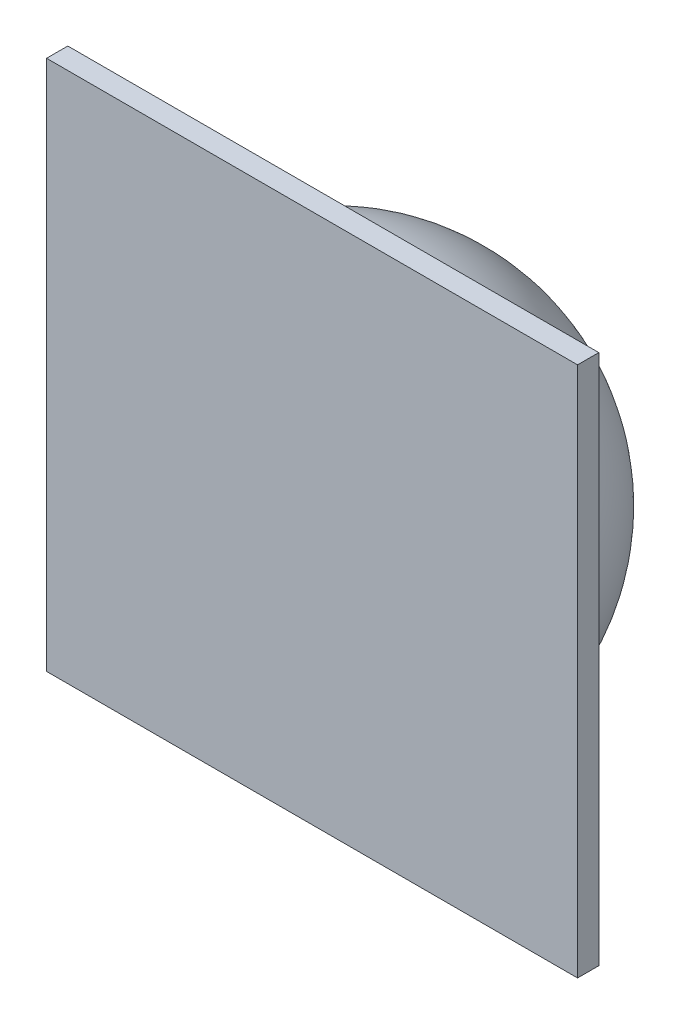
ISO-10303-21;
HEADER;
FILE_DESCRIPTION(('STEP AP214'),'2;1');
FILE_NAME('part.step','',(''),(''),'','','');
FILE_SCHEMA(('AUTOMOTIVE_DESIGN { 1 0 10303 214 1 1 1 1 }'));
ENDSEC;
DATA;
#1=APPLICATION_CONTEXT('core data for automotive mechanical design processes');
#2=APPLICATION_PROTOCOL_DEFINITION('international standard','automotive_design',2000,#1);
#3=PRODUCT_CONTEXT('',#1,'mechanical');
#4=PRODUCT('Part','Part','',(#3));
#5=PRODUCT_RELATED_PRODUCT_CATEGORY('part','',(#4));
#6=PRODUCT_DEFINITION_FORMATION('','',#4);
#7=PRODUCT_DEFINITION_CONTEXT('part definition',#1,'design');
#8=PRODUCT_DEFINITION('design','',#6,#7);
#9=PRODUCT_DEFINITION_SHAPE('','',#8);
#10=(LENGTH_UNIT() NAMED_UNIT(*) SI_UNIT(.MILLI.,.METRE.));
#11=(NAMED_UNIT(*) PLANE_ANGLE_UNIT() SI_UNIT($,.RADIAN.));
#12=(NAMED_UNIT(*) SI_UNIT($,.STERADIAN.) SOLID_ANGLE_UNIT());
#13=UNCERTAINTY_MEASURE_WITH_UNIT(LENGTH_MEASURE(1.E-05),#10,'distance_accuracy_value','');
#14=(GEOMETRIC_REPRESENTATION_CONTEXT(3) GLOBAL_UNCERTAINTY_ASSIGNED_CONTEXT((#13)) GLOBAL_UNIT_ASSIGNED_CONTEXT((#10,
#11,#12)) REPRESENTATION_CONTEXT('',''));
#15=CARTESIAN_POINT('',(0.,0.,0.));
#16=DIRECTION('',(0.,0.,1.));
#17=DIRECTION('',(1.,0.,0.));
#18=AXIS2_PLACEMENT_3D('',#15,#16,#17);
#19=CARTESIAN_POINT('',(0.,0.,-2.80389993930281));
#20=DIRECTION('',(0.,0.,-1.));
#21=DIRECTION('',(-1.,0.,0.));
#22=AXIS2_PLACEMENT_3D('',#19,#20,#21);
#23=PLANE('',#22);
#24=DIRECTION('',(0.,1.,0.));
#25=VECTOR('',#24,1.);
#26=CARTESIAN_POINT('',(7.5,-7.5,-2.80389993930281));
#27=LINE('',#26,#25);
#28=CARTESIAN_POINT('',(7.5,-7.5,-2.80389993930281));
#29=VERTEX_POINT('',#28);
#30=CARTESIAN_POINT('',(7.5,7.5,-2.80389993930281));
#31=VERTEX_POINT('',#30);
#32=EDGE_CURVE('E145',#29,#31,#27,.T.);
#33=ORIENTED_EDGE('',*,*,#32,.F.);
#34=DIRECTION('',(1.,0.,0.));
#35=VECTOR('',#34,1.);
#36=CARTESIAN_POINT('',(-7.5,-7.5,-2.80389993930281));
#37=LINE('',#36,#35);
#38=CARTESIAN_POINT('',(-7.5,-7.5,-2.80389993930281));
#39=VERTEX_POINT('',#38);
#40=EDGE_CURVE('E87',#39,#29,#37,.T.);
#41=ORIENTED_EDGE('',*,*,#40,.F.);
#42=DIRECTION('',(0.,-1.,0.));
#43=VECTOR('',#42,1.);
#44=CARTESIAN_POINT('',(-7.5,-7.5,-2.80389993930281));
#45=LINE('',#44,#43);
#46=CARTESIAN_POINT('',(-7.5,7.5,-2.80389993930281));
#47=VERTEX_POINT('',#46);
#48=EDGE_CURVE('E168',#47,#39,#45,.T.);
#49=ORIENTED_EDGE('',*,*,#48,.F.);
#50=DIRECTION('',(-1.,0.,0.));
#51=VECTOR('',#50,1.);
#52=CARTESIAN_POINT('',(-7.5,7.5,-2.80389993930281));
#53=LINE('',#52,#51);
#54=EDGE_CURVE('E150',#31,#47,#53,.T.);
#55=ORIENTED_EDGE('',*,*,#54,.F.);
#56=EDGE_LOOP('',(#33,#41,#49,#55));
#57=FACE_BOUND('',#56,.T.);
#58=CARTESIAN_POINT('',(0.,0.,-2.80389993930281));
#59=DIRECTION('',(0.,0.,-1.));
#60=DIRECTION('',(-1.,0.,0.));
#61=AXIS2_PLACEMENT_3D('',#58,#59,#60);
#62=CIRCLE('',#61,6.);
#63=CARTESIAN_POINT('',(-6.,0.,-2.80389993930281));
#64=VERTEX_POINT('',#63);
#65=EDGE_CURVE('E11',#64,#64,#62,.T.);
#66=ORIENTED_EDGE('',*,*,#65,.F.);
#67=EDGE_LOOP('',(#66));
#68=FACE_BOUND('',#67,.T.);
#69=ADVANCED_FACE('F40',(#57,#68),#23,.T.);
#70=CARTESIAN_POINT('',(7.5,-7.5,-2.20389993930281));
#71=DIRECTION('',(-1.,0.,0.));
#72=DIRECTION('',(0.,0.,1.));
#73=AXIS2_PLACEMENT_3D('',#70,#71,#72);
#74=PLANE('',#73);
#75=ORIENTED_EDGE('',*,*,#32,.T.);
#76=DIRECTION('',(0.,0.,-1.));
#77=VECTOR('',#76,1.);
#78=CARTESIAN_POINT('',(7.5,7.5,-2.20389993930281));
#79=LINE('',#78,#77);
#80=CARTESIAN_POINT('',(7.5,7.5,-2.20389993930281));
#81=VERTEX_POINT('',#80);
#82=EDGE_CURVE('E182',#81,#31,#79,.T.);
#83=ORIENTED_EDGE('',*,*,#82,.F.);
#84=DIRECTION('',(0.,1.,0.));
#85=VECTOR('',#84,1.);
#86=CARTESIAN_POINT('',(7.5,-7.5,-2.20389993930281));
#87=LINE('',#86,#85);
#88=CARTESIAN_POINT('',(7.5,-7.5,-2.20389993930281));
#89=VERTEX_POINT('',#88);
#90=EDGE_CURVE('E155',#89,#81,#87,.T.);
#91=ORIENTED_EDGE('',*,*,#90,.F.);
#92=DIRECTION('',(0.,0.,-1.));
#93=VECTOR('',#92,1.);
#94=CARTESIAN_POINT('',(7.5,-7.5,-2.20389993930281));
#95=LINE('',#94,#93);
#96=EDGE_CURVE('E164',#89,#29,#95,.T.);
#97=ORIENTED_EDGE('',*,*,#96,.T.);
#98=EDGE_LOOP('',(#75,#83,#91,#97));
#99=FACE_BOUND('',#98,.T.);
#100=ADVANCED_FACE('F42',(#99),#74,.F.);
#101=CARTESIAN_POINT('',(-7.5,7.5,-2.20389993930281));
#102=DIRECTION('',(0.,-1.,0.));
#103=DIRECTION('',(0.,0.,-1.));
#104=AXIS2_PLACEMENT_3D('',#101,#102,#103);
#105=PLANE('',#104);
#106=ORIENTED_EDGE('',*,*,#54,.T.);
#107=DIRECTION('',(0.,0.,-1.));
#108=VECTOR('',#107,1.);
#109=CARTESIAN_POINT('',(-7.5,7.5,-2.20389993930281));
#110=LINE('',#109,#108);
#111=CARTESIAN_POINT('',(-7.5,7.5,-2.20389993930281));
#112=VERTEX_POINT('',#111);
#113=EDGE_CURVE('E178',#112,#47,#110,.T.);
#114=ORIENTED_EDGE('',*,*,#113,.F.);
#115=DIRECTION('',(-1.,0.,0.));
#116=VECTOR('',#115,1.);
#117=CARTESIAN_POINT('',(-7.5,7.5,-2.20389993930281));
#118=LINE('',#117,#116);
#119=EDGE_CURVE('E95',#81,#112,#118,.T.);
#120=ORIENTED_EDGE('',*,*,#119,.F.);
#121=ORIENTED_EDGE('',*,*,#82,.T.);
#122=EDGE_LOOP('',(#106,#114,#120,#121));
#123=FACE_BOUND('',#122,.T.);
#124=ADVANCED_FACE('F247',(#123),#105,.F.);
#125=CARTESIAN_POINT('',(-7.5,-7.5,-2.20389993930281));
#126=DIRECTION('',(1.,0.,0.));
#127=DIRECTION('',(0.,0.,-1.));
#128=AXIS2_PLACEMENT_3D('',#125,#126,#127);
#129=PLANE('',#128);
#130=ORIENTED_EDGE('',*,*,#48,.T.);
#131=DIRECTION('',(0.,0.,-1.));
#132=VECTOR('',#131,1.);
#133=CARTESIAN_POINT('',(-7.5,-7.5,-2.20389993930281));
#134=LINE('',#133,#132);
#135=CARTESIAN_POINT('',(-7.5,-7.5,-2.20389993930281));
#136=VERTEX_POINT('',#135);
#137=EDGE_CURVE('E175',#136,#39,#134,.T.);
#138=ORIENTED_EDGE('',*,*,#137,.F.);
#139=DIRECTION('',(0.,-1.,0.));
#140=VECTOR('',#139,1.);
#141=CARTESIAN_POINT('',(-7.5,-7.5,-2.20389993930281));
#142=LINE('',#141,#140);
#143=EDGE_CURVE('E160',#112,#136,#142,.T.);
#144=ORIENTED_EDGE('',*,*,#143,.F.);
#145=ORIENTED_EDGE('',*,*,#113,.T.);
#146=EDGE_LOOP('',(#130,#138,#144,#145));
#147=FACE_BOUND('',#146,.T.);
#148=ADVANCED_FACE('F245',(#147),#129,.F.);
#149=CARTESIAN_POINT('',(-7.5,-7.5,-2.20389993930281));
#150=DIRECTION('',(0.,1.,0.));
#151=DIRECTION('',(0.,0.,1.));
#152=AXIS2_PLACEMENT_3D('',#149,#150,#151);
#153=PLANE('',#152);
#154=ORIENTED_EDGE('',*,*,#40,.T.);
#155=ORIENTED_EDGE('',*,*,#96,.F.);
#156=DIRECTION('',(1.,0.,0.));
#157=VECTOR('',#156,1.);
#158=CARTESIAN_POINT('',(-7.5,-7.5,-2.20389993930281));
#159=LINE('',#158,#157);
#160=EDGE_CURVE('E66',#136,#89,#159,.T.);
#161=ORIENTED_EDGE('',*,*,#160,.F.);
#162=ORIENTED_EDGE('',*,*,#137,.T.);
#163=EDGE_LOOP('',(#154,#155,#161,#162));
#164=FACE_BOUND('',#163,.T.);
#165=ADVANCED_FACE('F239',(#164),#153,.F.);
#166=CARTESIAN_POINT('',(0.,0.,-2.20389993930281));
#167=DIRECTION('',(0.,0.,-1.));
#168=DIRECTION('',(-1.,0.,0.));
#169=AXIS2_PLACEMENT_3D('',#166,#167,#168);
#170=PLANE('',#169);
#171=ORIENTED_EDGE('',*,*,#90,.T.);
#172=ORIENTED_EDGE('',*,*,#119,.T.);
#173=ORIENTED_EDGE('',*,*,#143,.T.);
#174=ORIENTED_EDGE('',*,*,#160,.T.);
#175=EDGE_LOOP('',(#171,#172,#173,#174));
#176=FACE_BOUND('',#175,.T.);
#177=ADVANCED_FACE('F236',(#176),#170,.F.);
#178=CARTESIAN_POINT('',(0.,0.,-2.80389993930281));
#179=DIRECTION('',(0.,0.,1.));
#180=DIRECTION('',(0.,-1.,0.));
#181=AXIS2_PLACEMENT_3D('',#178,#179,#180);
#182=SPHERICAL_SURFACE('',#181,6.);
#183=ORIENTED_EDGE('',*,*,#65,.T.);
#184=EDGE_LOOP('',(#183));
#185=FACE_BOUND('',#184,.T.);
#186=ADVANCED_FACE('F233',(#185),#182,.T.);
#187=CLOSED_SHELL('',(#69,#100,#124,#148,#165,#177,#186));
#188=CARTESIAN_POINT('',(0.,0.,-2.80389993930281));
#189=DIRECTION('',(0.,0.,-1.));
#190=DIRECTION('',(-1.,0.,0.));
#191=AXIS2_PLACEMENT_3D('',#188,#189,#190);
#192=CIRCLE('',#191,5.4);
#193=CARTESIAN_POINT('',(-5.4,0.,-2.80389993930281));
#194=VERTEX_POINT('',#193);
#195=EDGE_CURVE('E50',#194,#194,#192,.F.);
#196=ORIENTED_EDGE('',*,*,#195,.F.);
#197=EDGE_LOOP('',(#196));
#198=FACE_BOUND('',#197,.T.);
#199=DIRECTION('',(1.,0.,0.));
#200=VECTOR('',#199,1.);
#201=CARTESIAN_POINT('',(1.,1.,-2.80389993930281));
#202=LINE('',#201,#200);
#203=CARTESIAN_POINT('',(-1.,1.,-2.80389993930281));
#204=VERTEX_POINT('',#203);
#205=CARTESIAN_POINT('',(1.,1.,-2.80389993930281));
#206=VERTEX_POINT('',#205);
#207=EDGE_CURVE('E196',#204,#206,#202,.T.);
#208=ORIENTED_EDGE('',*,*,#207,.F.);
#209=DIRECTION('',(0.,1.,0.));
#210=VECTOR('',#209,1.);
#211=CARTESIAN_POINT('',(-1.,-1.,-2.80389993930281));
#212=LINE('',#211,#210);
#213=CARTESIAN_POINT('',(-1.,-1.,-2.80389993930281));
#214=VERTEX_POINT('',#213);
#215=EDGE_CURVE('E142',#214,#204,#212,.T.);
#216=ORIENTED_EDGE('',*,*,#215,.F.);
#217=DIRECTION('',(-1.,0.,0.));
#218=VECTOR('',#217,1.);
#219=CARTESIAN_POINT('',(1.,-1.,-2.80389993930281));
#220=LINE('',#219,#218);
#221=CARTESIAN_POINT('',(1.,-1.,-2.80389993930281));
#222=VERTEX_POINT('',#221);
#223=EDGE_CURVE('E138',#222,#214,#220,.T.);
#224=ORIENTED_EDGE('',*,*,#223,.F.);
#225=DIRECTION('',(0.,-1.,0.));
#226=VECTOR('',#225,1.);
#227=CARTESIAN_POINT('',(1.,-1.,-2.80389993930281));
#228=LINE('',#227,#226);
#229=EDGE_CURVE('E198',#206,#222,#228,.T.);
#230=ORIENTED_EDGE('',*,*,#229,.F.);
#231=EDGE_LOOP('',(#208,#216,#224,#230));
#232=FACE_BOUND('',#231,.T.);
#233=ADVANCED_FACE('F190',(#198,#232),#23,.T.);
#234=CARTESIAN_POINT('',(0.,0.,-2.80389993930281));
#235=DIRECTION('',(0.,0.,1.));
#236=DIRECTION('',(0.,-1.,0.));
#237=AXIS2_PLACEMENT_3D('',#234,#235,#236);
#238=SPHERICAL_SURFACE('',#237,5.4);
#239=ORIENTED_EDGE('',*,*,#195,.T.);
#240=EDGE_LOOP('',(#239));
#241=FACE_BOUND('',#240,.T.);
#242=ADVANCED_FACE('F188',(#241),#238,.F.);
#243=CARTESIAN_POINT('',(-1.,-1.,-4.8038999393028));
#244=DIRECTION('',(1.,0.,0.));
#245=DIRECTION('',(0.,0.,-1.));
#246=AXIS2_PLACEMENT_3D('',#243,#244,#245);
#247=PLANE('',#246);
#248=ORIENTED_EDGE('',*,*,#215,.T.);
#249=DIRECTION('',(0.,0.,1.));
#250=VECTOR('',#249,1.);
#251=CARTESIAN_POINT('',(-1.,1.,-4.8038999393028));
#252=LINE('',#251,#250);
#253=CARTESIAN_POINT('',(-1.,1.,-4.8038999393028));
#254=VERTEX_POINT('',#253);
#255=EDGE_CURVE('E121',#254,#204,#252,.T.);
#256=ORIENTED_EDGE('',*,*,#255,.F.);
#257=DIRECTION('',(0.,1.,0.));
#258=VECTOR('',#257,1.);
#259=CARTESIAN_POINT('',(-1.,-1.,-4.8038999393028));
#260=LINE('',#259,#258);
#261=CARTESIAN_POINT('',(-1.,-1.,-4.8038999393028));
#262=VERTEX_POINT('',#261);
#263=EDGE_CURVE('E129',#262,#254,#260,.T.);
#264=ORIENTED_EDGE('',*,*,#263,.F.);
#265=DIRECTION('',(0.,0.,1.));
#266=VECTOR('',#265,1.);
#267=CARTESIAN_POINT('',(-1.,-1.,-4.8038999393028));
#268=LINE('',#267,#266);
#269=EDGE_CURVE('E209',#262,#214,#268,.T.);
#270=ORIENTED_EDGE('',*,*,#269,.T.);
#271=EDGE_LOOP('',(#248,#256,#264,#270));
#272=FACE_BOUND('',#271,.T.);
#273=ADVANCED_FACE('F140',(#272),#247,.F.);
#274=CARTESIAN_POINT('',(1.,1.,-4.8038999393028));
#275=DIRECTION('',(0.,-1.,0.));
#276=DIRECTION('',(0.,0.,-1.));
#277=AXIS2_PLACEMENT_3D('',#274,#275,#276);
#278=PLANE('',#277);
#279=ORIENTED_EDGE('',*,*,#207,.T.);
#280=DIRECTION('',(0.,0.,1.));
#281=VECTOR('',#280,1.);
#282=CARTESIAN_POINT('',(1.,1.,-4.8038999393028));
#283=LINE('',#282,#281);
#284=CARTESIAN_POINT('',(1.,1.,-4.8038999393028));
#285=VERTEX_POINT('',#284);
#286=EDGE_CURVE('E124',#285,#206,#283,.T.);
#287=ORIENTED_EDGE('',*,*,#286,.F.);
#288=DIRECTION('',(1.,0.,0.));
#289=VECTOR('',#288,1.);
#290=CARTESIAN_POINT('',(1.,1.,-4.8038999393028));
#291=LINE('',#290,#289);
#292=EDGE_CURVE('E117',#254,#285,#291,.T.);
#293=ORIENTED_EDGE('',*,*,#292,.F.);
#294=ORIENTED_EDGE('',*,*,#255,.T.);
#295=EDGE_LOOP('',(#279,#287,#293,#294));
#296=FACE_BOUND('',#295,.T.);
#297=ADVANCED_FACE('F119',(#296),#278,.F.);
#298=CARTESIAN_POINT('',(1.,-1.,-4.8038999393028));
#299=DIRECTION('',(-1.,0.,0.));
#300=DIRECTION('',(0.,0.,1.));
#301=AXIS2_PLACEMENT_3D('',#298,#299,#300);
#302=PLANE('',#301);
#303=ORIENTED_EDGE('',*,*,#229,.T.);
#304=DIRECTION('',(0.,0.,1.));
#305=VECTOR('',#304,1.);
#306=CARTESIAN_POINT('',(1.,-1.,-4.8038999393028));
#307=LINE('',#306,#305);
#308=CARTESIAN_POINT('',(1.,-1.,-4.8038999393028));
#309=VERTEX_POINT('',#308);
#310=EDGE_CURVE('E57',#309,#222,#307,.T.);
#311=ORIENTED_EDGE('',*,*,#310,.F.);
#312=DIRECTION('',(0.,-1.,0.));
#313=VECTOR('',#312,1.);
#314=CARTESIAN_POINT('',(1.,-1.,-4.8038999393028));
#315=LINE('',#314,#313);
#316=EDGE_CURVE('E128',#285,#309,#315,.T.);
#317=ORIENTED_EDGE('',*,*,#316,.F.);
#318=ORIENTED_EDGE('',*,*,#286,.T.);
#319=EDGE_LOOP('',(#303,#311,#317,#318));
#320=FACE_BOUND('',#319,.T.);
#321=ADVANCED_FACE('F216',(#320),#302,.F.);
#322=CARTESIAN_POINT('',(1.,-1.,-4.8038999393028));
#323=DIRECTION('',(0.,1.,0.));
#324=DIRECTION('',(0.,0.,1.));
#325=AXIS2_PLACEMENT_3D('',#322,#323,#324);
#326=PLANE('',#325);
#327=ORIENTED_EDGE('',*,*,#223,.T.);
#328=ORIENTED_EDGE('',*,*,#269,.F.);
#329=DIRECTION('',(-1.,0.,0.));
#330=VECTOR('',#329,1.);
#331=CARTESIAN_POINT('',(1.,-1.,-4.8038999393028));
#332=LINE('',#331,#330);
#333=EDGE_CURVE('E133',#309,#262,#332,.T.);
#334=ORIENTED_EDGE('',*,*,#333,.F.);
#335=ORIENTED_EDGE('',*,*,#310,.T.);
#336=EDGE_LOOP('',(#327,#328,#334,#335));
#337=FACE_BOUND('',#336,.T.);
#338=ADVANCED_FACE('F217',(#337),#326,.F.);
#339=CARTESIAN_POINT('',(0.,0.,-4.8038999393028));
#340=DIRECTION('',(0.,0.,1.));
#341=DIRECTION('',(1.,0.,0.));
#342=AXIS2_PLACEMENT_3D('',#339,#340,#341);
#343=PLANE('',#342);
#344=ORIENTED_EDGE('',*,*,#263,.T.);
#345=ORIENTED_EDGE('',*,*,#292,.T.);
#346=ORIENTED_EDGE('',*,*,#316,.T.);
#347=ORIENTED_EDGE('',*,*,#333,.T.);
#348=EDGE_LOOP('',(#344,#345,#346,#347));
#349=FACE_BOUND('',#348,.T.);
#350=ADVANCED_FACE('F132',(#349),#343,.F.);
#351=CLOSED_SHELL('',(#233,#242,#273,#297,#321,#338,#350));
#352=ORIENTED_CLOSED_SHELL('',*,#351,.T.);
#353=BREP_WITH_VOIDS('B2',#187,(#352));
#354=ADVANCED_BREP_SHAPE_REPRESENTATION('',(#18,#353),#14);
#355=SHAPE_DEFINITION_REPRESENTATION(#9,#354);
ENDSEC;
END-ISO-10303-21;
